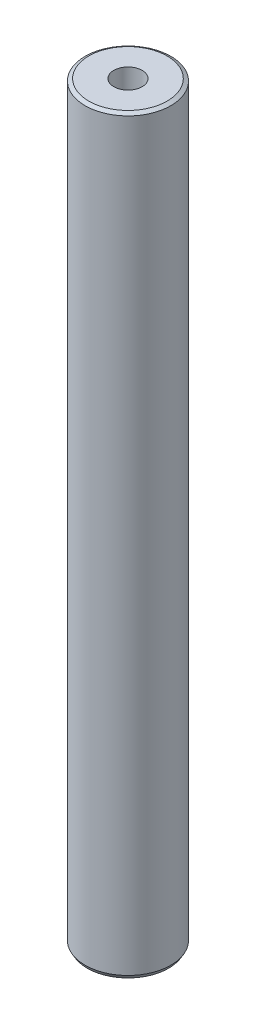
ISO-10303-21;
HEADER;
FILE_DESCRIPTION(('STEP AP214'),'2;1');
FILE_NAME('part.step','',(''),(''),'','','');
FILE_SCHEMA(('AUTOMOTIVE_DESIGN { 1 0 10303 214 1 1 1 1 }'));
ENDSEC;
DATA;
#1=APPLICATION_CONTEXT('core data for automotive mechanical design processes');
#2=APPLICATION_PROTOCOL_DEFINITION('international standard','automotive_design',2000,#1);
#3=PRODUCT_CONTEXT('',#1,'mechanical');
#4=PRODUCT('Part','Part','',(#3));
#5=PRODUCT_RELATED_PRODUCT_CATEGORY('part','',(#4));
#6=PRODUCT_DEFINITION_FORMATION('','',#4);
#7=PRODUCT_DEFINITION_CONTEXT('part definition',#1,'design');
#8=PRODUCT_DEFINITION('design','',#6,#7);
#9=PRODUCT_DEFINITION_SHAPE('','',#8);
#10=(LENGTH_UNIT() NAMED_UNIT(*) SI_UNIT(.MILLI.,.METRE.));
#11=(NAMED_UNIT(*) PLANE_ANGLE_UNIT() SI_UNIT($,.RADIAN.));
#12=(NAMED_UNIT(*) SI_UNIT($,.STERADIAN.) SOLID_ANGLE_UNIT());
#13=UNCERTAINTY_MEASURE_WITH_UNIT(LENGTH_MEASURE(1.E-05),#10,'distance_accuracy_value','');
#14=(GEOMETRIC_REPRESENTATION_CONTEXT(3) GLOBAL_UNCERTAINTY_ASSIGNED_CONTEXT((#13)) GLOBAL_UNIT_ASSIGNED_CONTEXT((#10,
#11,#12)) REPRESENTATION_CONTEXT('',''));
#15=CARTESIAN_POINT('',(0.,0.,0.));
#16=DIRECTION('',(0.,0.,1.));
#17=DIRECTION('',(1.,0.,0.));
#18=AXIS2_PLACEMENT_3D('',#15,#16,#17);
#19=CARTESIAN_POINT('',(0.,569.131867103642,0.));
#20=DIRECTION('',(0.,-1.,0.));
#21=DIRECTION('',(0.,0.,-1.));
#22=AXIS2_PLACEMENT_3D('',#19,#20,#21);
#23=CYLINDRICAL_SURFACE('',#22,32.5);
#24=CARTESIAN_POINT('',(0.,567.520631549671,0.));
#25=DIRECTION('',(0.,1.,0.));
#26=DIRECTION('',(0.,0.,1.));
#27=AXIS2_PLACEMENT_3D('',#24,#25,#26);
#28=CIRCLE('',#27,32.5);
#29=CARTESIAN_POINT('',(0.,567.520631549671,32.5));
#30=VERTEX_POINT('',#29);
#31=EDGE_CURVE('E50',#30,#30,#28,.F.);
#32=ORIENTED_EDGE('',*,*,#31,.T.);
#33=EDGE_LOOP('',(#32));
#34=FACE_BOUND('',#33,.T.);
#35=CARTESIAN_POINT('',(0.,2.79074184244066,0.));
#36=DIRECTION('',(0.,1.,0.));
#37=DIRECTION('',(0.,0.,1.));
#38=AXIS2_PLACEMENT_3D('',#35,#36,#37);
#39=CIRCLE('',#38,32.5);
#40=CARTESIAN_POINT('',(0.,2.79074184244066,32.5));
#41=VERTEX_POINT('',#40);
#42=EDGE_CURVE('E51',#41,#41,#39,.T.);
#43=ORIENTED_EDGE('',*,*,#42,.T.);
#44=EDGE_LOOP('',(#43));
#45=FACE_BOUND('',#44,.T.);
#46=ADVANCED_FACE('F39',(#34,#45),#23,.T.);
#47=CARTESIAN_POINT('',(0.,569.131867103642,0.));
#48=DIRECTION('',(0.,1.,0.));
#49=DIRECTION('',(0.,0.,1.));
#50=AXIS2_PLACEMENT_3D('',#47,#48,#49);
#51=PLANE('',#50);
#52=CARTESIAN_POINT('',(0.,569.131867103642,0.));
#53=DIRECTION('',(0.,1.,0.));
#54=DIRECTION('',(0.,0.,1.));
#55=AXIS2_PLACEMENT_3D('',#52,#53,#54);
#56=CIRCLE('',#55,29.7092581575595);
#57=CARTESIAN_POINT('',(0.,569.131867103642,29.7092581575595));
#58=VERTEX_POINT('',#57);
#59=EDGE_CURVE('E54',#58,#58,#56,.T.);
#60=ORIENTED_EDGE('',*,*,#59,.T.);
#61=EDGE_LOOP('',(#60));
#62=FACE_BOUND('',#61,.T.);
#63=CARTESIAN_POINT('',(0.,569.131867103642,0.));
#64=DIRECTION('',(0.,1.,0.));
#65=DIRECTION('',(0.,0.,1.));
#66=AXIS2_PLACEMENT_3D('',#63,#64,#65);
#67=CIRCLE('',#66,10.7627768277513);
#68=CARTESIAN_POINT('',(0.,569.131867103642,10.7627768277513));
#69=VERTEX_POINT('',#68);
#70=EDGE_CURVE('E58',#69,#69,#67,.T.);
#71=ORIENTED_EDGE('',*,*,#70,.F.);
#72=EDGE_LOOP('',(#71));
#73=FACE_BOUND('',#72,.T.);
#74=ADVANCED_FACE('F69',(#62,#73),#51,.T.);
#75=CARTESIAN_POINT('',(0.,0.,0.));
#76=DIRECTION('',(0.,1.,0.));
#77=DIRECTION('',(0.,0.,1.));
#78=AXIS2_PLACEMENT_3D('',#75,#76,#77);
#79=PLANE('',#78);
#80=CARTESIAN_POINT('',(0.,0.,0.));
#81=DIRECTION('',(0.,1.,0.));
#82=DIRECTION('',(0.,0.,1.));
#83=AXIS2_PLACEMENT_3D('',#80,#81,#82);
#84=CIRCLE('',#83,30.8887644460281);
#85=CARTESIAN_POINT('',(0.,0.,30.8887644460281));
#86=VERTEX_POINT('',#85);
#87=EDGE_CURVE('E10',#86,#86,#84,.F.);
#88=ORIENTED_EDGE('',*,*,#87,.T.);
#89=EDGE_LOOP('',(#88));
#90=FACE_BOUND('',#89,.T.);
#91=CARTESIAN_POINT('',(0.,0.,0.));
#92=DIRECTION('',(0.,1.,0.));
#93=DIRECTION('',(0.,0.,1.));
#94=AXIS2_PLACEMENT_3D('',#91,#92,#93);
#95=CIRCLE('',#94,10.7627768277513);
#96=CARTESIAN_POINT('',(0.,0.,10.7627768277513));
#97=VERTEX_POINT('',#96);
#98=EDGE_CURVE('E63',#97,#97,#95,.T.);
#99=ORIENTED_EDGE('',*,*,#98,.T.);
#100=EDGE_LOOP('',(#99));
#101=FACE_BOUND('',#100,.T.);
#102=ADVANCED_FACE('F75',(#90,#101),#79,.F.);
#103=CARTESIAN_POINT('',(0.,569.131867103642,0.));
#104=DIRECTION('',(0.,-1.,0.));
#105=DIRECTION('',(0.,0.,-1.));
#106=AXIS2_PLACEMENT_3D('',#103,#104,#105);
#107=CYLINDRICAL_SURFACE('',#106,10.7627768277513);
#108=ORIENTED_EDGE('',*,*,#70,.T.);
#109=EDGE_LOOP('',(#108));
#110=FACE_BOUND('',#109,.T.);
#111=ORIENTED_EDGE('',*,*,#98,.F.);
#112=EDGE_LOOP('',(#111));
#113=FACE_BOUND('',#112,.T.);
#114=ADVANCED_FACE('F70',(#110,#113),#107,.F.);
#115=CARTESIAN_POINT('',(0.,569.131867103642,0.));
#116=DIRECTION('',(0.,-1.,0.));
#117=DIRECTION('',(0.,0.,-1.));
#118=AXIS2_PLACEMENT_3D('',#115,#116,#117);
#119=CONICAL_SURFACE('',#118,29.7092581575595,1.04719755119658);
#120=ORIENTED_EDGE('',*,*,#31,.F.);
#121=EDGE_LOOP('',(#120));
#122=FACE_BOUND('',#121,.T.);
#123=ORIENTED_EDGE('',*,*,#59,.F.);
#124=EDGE_LOOP('',(#123));
#125=FACE_BOUND('',#124,.T.);
#126=ADVANCED_FACE('F81',(#122,#125),#119,.T.);
#127=CARTESIAN_POINT('',(0.,2.79074184244066,0.));
#128=DIRECTION('',(0.,1.,0.));
#129=DIRECTION('',(0.,0.,1.));
#130=AXIS2_PLACEMENT_3D('',#127,#128,#129);
#131=CONICAL_SURFACE('',#130,32.5,0.523598775598319);
#132=ORIENTED_EDGE('',*,*,#87,.F.);
#133=EDGE_LOOP('',(#132));
#134=FACE_BOUND('',#133,.T.);
#135=ORIENTED_EDGE('',*,*,#42,.F.);
#136=EDGE_LOOP('',(#135));
#137=FACE_BOUND('',#136,.T.);
#138=ADVANCED_FACE('F45',(#134,#137),#131,.T.);
#139=CLOSED_SHELL('',(#46,#74,#102,#114,#126,#138));
#140=MANIFOLD_SOLID_BREP('B2',#139);
#141=ADVANCED_BREP_SHAPE_REPRESENTATION('',(#18,#140),#14);
#142=SHAPE_DEFINITION_REPRESENTATION(#9,#141);
ENDSEC;
END-ISO-10303-21;
